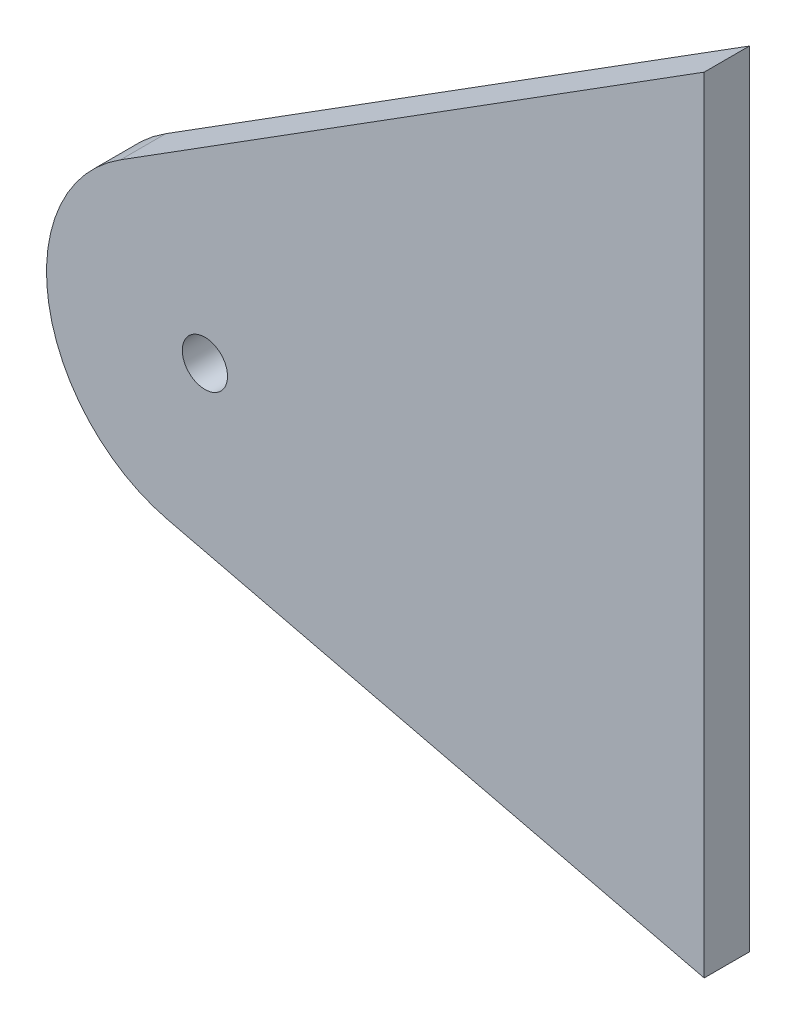
ISO-10303-21;
HEADER;
FILE_DESCRIPTION(('STEP AP214'),'2;1');
FILE_NAME('part.step','',(''),(''),'','','');
FILE_SCHEMA(('AUTOMOTIVE_DESIGN { 1 0 10303 214 1 1 1 1 }'));
ENDSEC;
DATA;
#1=APPLICATION_CONTEXT('core data for automotive mechanical design processes');
#2=APPLICATION_PROTOCOL_DEFINITION('international standard','automotive_design',2000,#1);
#3=PRODUCT_CONTEXT('',#1,'mechanical');
#4=PRODUCT('Part','Part','',(#3));
#5=PRODUCT_RELATED_PRODUCT_CATEGORY('part','',(#4));
#6=PRODUCT_DEFINITION_FORMATION('','',#4);
#7=PRODUCT_DEFINITION_CONTEXT('part definition',#1,'design');
#8=PRODUCT_DEFINITION('design','',#6,#7);
#9=PRODUCT_DEFINITION_SHAPE('','',#8);
#10=(LENGTH_UNIT() NAMED_UNIT(*) SI_UNIT(.MILLI.,.METRE.));
#11=(NAMED_UNIT(*) PLANE_ANGLE_UNIT() SI_UNIT($,.RADIAN.));
#12=(NAMED_UNIT(*) SI_UNIT($,.STERADIAN.) SOLID_ANGLE_UNIT());
#13=UNCERTAINTY_MEASURE_WITH_UNIT(LENGTH_MEASURE(1.E-05),#10,'distance_accuracy_value','');
#14=(GEOMETRIC_REPRESENTATION_CONTEXT(3) GLOBAL_UNCERTAINTY_ASSIGNED_CONTEXT((#13)) GLOBAL_UNIT_ASSIGNED_CONTEXT((#10,
#11,#12)) REPRESENTATION_CONTEXT('',''));
#15=CARTESIAN_POINT('',(0.,0.,0.));
#16=DIRECTION('',(0.,0.,1.));
#17=DIRECTION('',(1.,0.,0.));
#18=AXIS2_PLACEMENT_3D('',#15,#16,#17);
#19=CARTESIAN_POINT('',(-5.59744243595642,8.8836162780792,3.));
#20=DIRECTION('',(0.533089755805375,-0.846058693150402,0.));
#21=DIRECTION('',(0.846058693150402,0.533089755805375,0.));
#22=AXIS2_PLACEMENT_3D('',#19,#20,#21);
#23=PLANE('',#22);
#24=DIRECTION('',(-0.846058693150402,-0.533089755805375,0.));
#25=VECTOR('',#24,1.);
#26=CARTESIAN_POINT('',(-5.59744243595642,8.8836162780792,0.));
#27=LINE('',#26,#25);
#28=CARTESIAN_POINT('',(33.0925983016769,33.2616701127656,0.));
#29=VERTEX_POINT('',#28);
#30=CARTESIAN_POINT('',(-5.59744269832307,8.88361611276564,0.));
#31=VERTEX_POINT('',#30);
#32=EDGE_CURVE('E99',#29,#31,#27,.T.);
#33=ORIENTED_EDGE('',*,*,#32,.T.);
#34=DIRECTION('',(0.,0.,-1.));
#35=VECTOR('',#34,1.);
#36=CARTESIAN_POINT('',(-5.59744269832307,8.88361611276564,3.));
#37=LINE('',#36,#35);
#38=CARTESIAN_POINT('',(-5.59744269832307,8.88361611276564,3.));
#39=VERTEX_POINT('',#38);
#40=EDGE_CURVE('E11',#39,#31,#37,.T.);
#41=ORIENTED_EDGE('',*,*,#40,.F.);
#42=DIRECTION('',(-0.846058693150402,-0.533089755805375,0.));
#43=VECTOR('',#42,1.);
#44=CARTESIAN_POINT('',(-5.59744243595642,8.8836162780792,3.));
#45=LINE('',#44,#43);
#46=CARTESIAN_POINT('',(33.0925983016769,33.2616701127656,3.));
#47=VERTEX_POINT('',#46);
#48=EDGE_CURVE('E82',#47,#39,#45,.T.);
#49=ORIENTED_EDGE('',*,*,#48,.F.);
#50=DIRECTION('',(0.,0.,-1.));
#51=VECTOR('',#50,1.);
#52=CARTESIAN_POINT('',(33.0925983016769,33.2616701127656,3.));
#53=LINE('',#52,#51);
#54=EDGE_CURVE('E49',#47,#29,#53,.T.);
#55=ORIENTED_EDGE('',*,*,#54,.T.);
#56=EDGE_LOOP('',(#33,#41,#49,#55));
#57=FACE_BOUND('',#56,.T.);
#58=ADVANCED_FACE('F32',(#57),#23,.F.);
#59=CARTESIAN_POINT('',(0.,0.,3.));
#60=DIRECTION('',(0.,0.,-1.));
#61=DIRECTION('',(-1.,0.,0.));
#62=AXIS2_PLACEMENT_3D('',#59,#60,#61);
#63=CYLINDRICAL_SURFACE('',#62,10.5);
#64=CARTESIAN_POINT('',(0.,0.,0.));
#65=DIRECTION('',(0.,0.,1.));
#66=DIRECTION('',(1.,0.,0.));
#67=AXIS2_PLACEMENT_3D('',#64,#65,#66);
#68=CIRCLE('',#67,10.5);
#69=CARTESIAN_POINT('',(-2.44985669832307,-10.2102008872344,0.));
#70=VERTEX_POINT('',#69);
#71=EDGE_CURVE('E87',#31,#70,#68,.T.);
#72=ORIENTED_EDGE('',*,*,#71,.T.);
#73=DIRECTION('',(0.,0.,-1.));
#74=VECTOR('',#73,1.);
#75=CARTESIAN_POINT('',(-2.44985669832307,-10.2102008872344,3.));
#76=LINE('',#75,#74);
#77=CARTESIAN_POINT('',(-2.44985669832307,-10.2102008872344,3.));
#78=VERTEX_POINT('',#77);
#79=EDGE_CURVE('E41',#78,#70,#76,.T.);
#80=ORIENTED_EDGE('',*,*,#79,.F.);
#81=CARTESIAN_POINT('',(0.,0.,3.));
#82=DIRECTION('',(0.,0.,1.));
#83=DIRECTION('',(1.,0.,0.));
#84=AXIS2_PLACEMENT_3D('',#81,#82,#83);
#85=CIRCLE('',#84,10.5);
#86=EDGE_CURVE('E74',#39,#78,#85,.T.);
#87=ORIENTED_EDGE('',*,*,#86,.F.);
#88=ORIENTED_EDGE('',*,*,#40,.T.);
#89=EDGE_LOOP('',(#72,#80,#87,#88));
#90=FACE_BOUND('',#89,.T.);
#91=ADVANCED_FACE('F86',(#90),#63,.T.);
#92=CARTESIAN_POINT('',(-2.44985640104373,-10.2102009585642,3.));
#93=DIRECTION('',(-0.23331965724226,-0.972400091291827,0.));
#94=DIRECTION('',(0.972400091291827,-0.23331965724226,0.));
#95=AXIS2_PLACEMENT_3D('',#92,#93,#94);
#96=PLANE('',#95);
#97=DIRECTION('',(-0.972400091291827,0.23331965724226,0.));
#98=VECTOR('',#97,1.);
#99=CARTESIAN_POINT('',(-2.44985640104373,-10.2102009585642,0.));
#100=LINE('',#99,#98);
#101=CARTESIAN_POINT('',(33.0925983016769,-18.7383298872344,0.));
#102=VERTEX_POINT('',#101);
#103=EDGE_CURVE('E102',#102,#70,#100,.T.);
#104=ORIENTED_EDGE('',*,*,#103,.F.);
#105=DIRECTION('',(0.,0.,-1.));
#106=VECTOR('',#105,1.);
#107=CARTESIAN_POINT('',(33.0925983016769,-18.7383298872344,3.));
#108=LINE('',#107,#106);
#109=CARTESIAN_POINT('',(33.0925983016769,-18.7383298872344,3.));
#110=VERTEX_POINT('',#109);
#111=EDGE_CURVE('E63',#110,#102,#108,.T.);
#112=ORIENTED_EDGE('',*,*,#111,.F.);
#113=DIRECTION('',(-0.972400091291827,0.23331965724226,0.));
#114=VECTOR('',#113,1.);
#115=CARTESIAN_POINT('',(-2.44985640104373,-10.2102009585642,3.));
#116=LINE('',#115,#114);
#117=EDGE_CURVE('E81',#110,#78,#116,.T.);
#118=ORIENTED_EDGE('',*,*,#117,.T.);
#119=ORIENTED_EDGE('',*,*,#79,.T.);
#120=EDGE_LOOP('',(#104,#112,#118,#119));
#121=FACE_BOUND('',#120,.T.);
#122=ADVANCED_FACE('F90',(#121),#96,.T.);
#123=CARTESIAN_POINT('',(0.,0.,3.));
#124=DIRECTION('',(0.,0.,-1.));
#125=DIRECTION('',(-1.,0.,0.));
#126=AXIS2_PLACEMENT_3D('',#123,#124,#125);
#127=CYLINDRICAL_SURFACE('',#126,1.50000030167694);
#128=CARTESIAN_POINT('',(0.,0.,3.));
#129=DIRECTION('',(0.,0.,1.));
#130=DIRECTION('',(1.,0.,0.));
#131=AXIS2_PLACEMENT_3D('',#128,#129,#130);
#132=CIRCLE('',#131,1.50000030167694);
#133=CARTESIAN_POINT('',(1.50000030167694,0.,3.));
#134=VERTEX_POINT('',#133);
#135=EDGE_CURVE('E107',#134,#134,#132,.T.);
#136=ORIENTED_EDGE('',*,*,#135,.T.);
#137=EDGE_LOOP('',(#136));
#138=FACE_BOUND('',#137,.T.);
#139=CARTESIAN_POINT('',(0.,0.,0.));
#140=DIRECTION('',(0.,0.,1.));
#141=DIRECTION('',(1.,0.,0.));
#142=AXIS2_PLACEMENT_3D('',#139,#140,#141);
#143=CIRCLE('',#142,1.50000030167694);
#144=CARTESIAN_POINT('',(1.50000030167694,0.,0.));
#145=VERTEX_POINT('',#144);
#146=EDGE_CURVE('E96',#145,#145,#143,.T.);
#147=ORIENTED_EDGE('',*,*,#146,.F.);
#148=EDGE_LOOP('',(#147));
#149=FACE_BOUND('',#148,.T.);
#150=ADVANCED_FACE('F34',(#138,#149),#127,.F.);
#151=CARTESIAN_POINT('',(33.0925983016769,0.,3.));
#152=DIRECTION('',(1.,0.,0.));
#153=DIRECTION('',(0.,0.,-1.));
#154=AXIS2_PLACEMENT_3D('',#151,#152,#153);
#155=PLANE('',#154);
#156=DIRECTION('',(0.,-1.,0.));
#157=VECTOR('',#156,1.);
#158=CARTESIAN_POINT('',(33.0925983016769,0.,0.));
#159=LINE('',#158,#157);
#160=EDGE_CURVE('E104',#29,#102,#159,.T.);
#161=ORIENTED_EDGE('',*,*,#160,.F.);
#162=ORIENTED_EDGE('',*,*,#54,.F.);
#163=DIRECTION('',(0.,-1.,0.));
#164=VECTOR('',#163,1.);
#165=CARTESIAN_POINT('',(33.0925983016769,0.,3.));
#166=LINE('',#165,#164);
#167=EDGE_CURVE('E91',#47,#110,#166,.T.);
#168=ORIENTED_EDGE('',*,*,#167,.T.);
#169=ORIENTED_EDGE('',*,*,#111,.T.);
#170=EDGE_LOOP('',(#161,#162,#168,#169));
#171=FACE_BOUND('',#170,.T.);
#172=ADVANCED_FACE('F118',(#171),#155,.T.);
#173=CARTESIAN_POINT('',(0.,0.,3.));
#174=DIRECTION('',(0.,0.,1.));
#175=DIRECTION('',(1.,0.,0.));
#176=AXIS2_PLACEMENT_3D('',#173,#174,#175);
#177=PLANE('',#176);
#178=ORIENTED_EDGE('',*,*,#135,.F.);
#179=EDGE_LOOP('',(#178));
#180=FACE_BOUND('',#179,.T.);
#181=ORIENTED_EDGE('',*,*,#48,.T.);
#182=ORIENTED_EDGE('',*,*,#86,.T.);
#183=ORIENTED_EDGE('',*,*,#117,.F.);
#184=ORIENTED_EDGE('',*,*,#167,.F.);
#185=EDGE_LOOP('',(#181,#182,#183,#184));
#186=FACE_BOUND('',#185,.T.);
#187=ADVANCED_FACE('F78',(#180,#186),#177,.T.);
#188=CARTESIAN_POINT('',(0.,0.,0.));
#189=DIRECTION('',(0.,0.,1.));
#190=DIRECTION('',(1.,0.,0.));
#191=AXIS2_PLACEMENT_3D('',#188,#189,#190);
#192=PLANE('',#191);
#193=ORIENTED_EDGE('',*,*,#146,.T.);
#194=EDGE_LOOP('',(#193));
#195=FACE_BOUND('',#194,.T.);
#196=ORIENTED_EDGE('',*,*,#32,.F.);
#197=ORIENTED_EDGE('',*,*,#160,.T.);
#198=ORIENTED_EDGE('',*,*,#103,.T.);
#199=ORIENTED_EDGE('',*,*,#71,.F.);
#200=EDGE_LOOP('',(#196,#197,#198,#199));
#201=FACE_BOUND('',#200,.T.);
#202=ADVANCED_FACE('F117',(#195,#201),#192,.F.);
#203=CLOSED_SHELL('',(#58,#91,#122,#150,#172,#187,#202));
#204=MANIFOLD_SOLID_BREP('B2',#203);
#205=ADVANCED_BREP_SHAPE_REPRESENTATION('',(#18,#204),#14);
#206=SHAPE_DEFINITION_REPRESENTATION(#9,#205);
ENDSEC;
END-ISO-10303-21;
